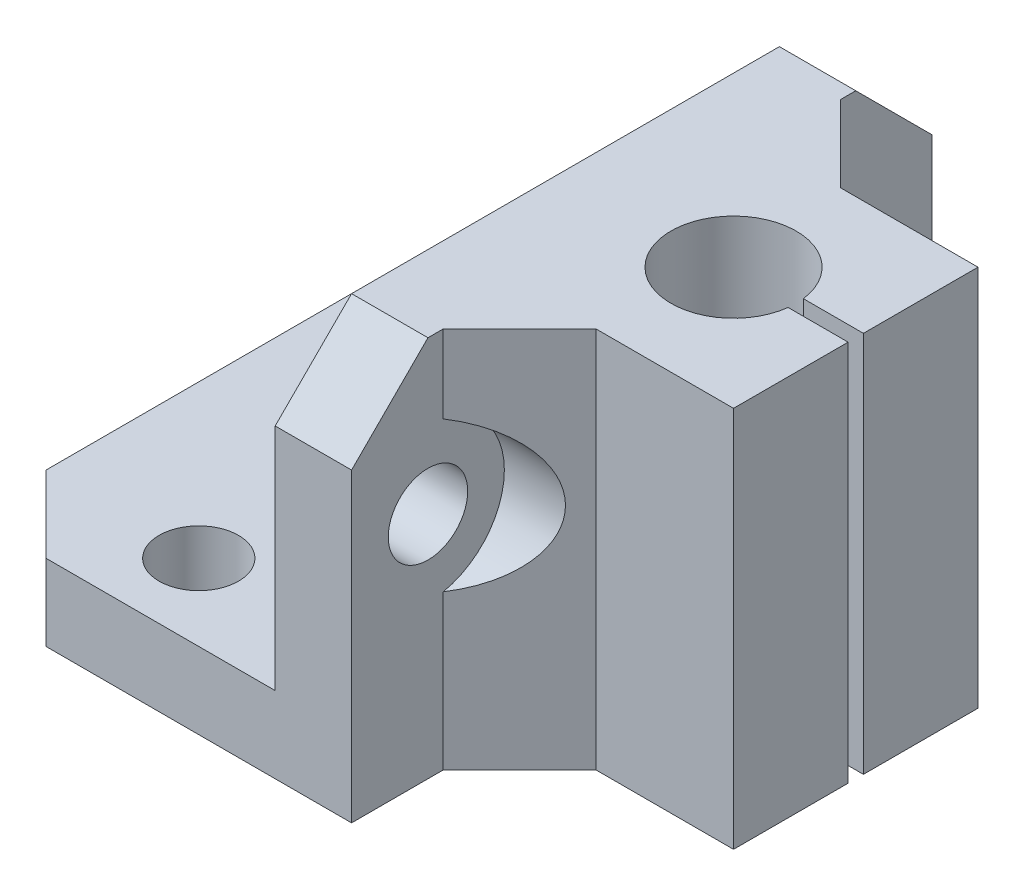
ISO-10303-21;
HEADER;
FILE_DESCRIPTION(('STEP AP214'),'2;1');
FILE_NAME('part.step','',(''),(''),'','','');
FILE_SCHEMA(('AUTOMOTIVE_DESIGN { 1 0 10303 214 1 1 1 1 }'));
ENDSEC;
DATA;
#1=APPLICATION_CONTEXT('core data for automotive mechanical design processes');
#2=APPLICATION_PROTOCOL_DEFINITION('international standard','automotive_design',2000,#1);
#3=PRODUCT_CONTEXT('',#1,'mechanical');
#4=PRODUCT('Part','Part','',(#3));
#5=PRODUCT_RELATED_PRODUCT_CATEGORY('part','',(#4));
#6=PRODUCT_DEFINITION_FORMATION('','',#4);
#7=PRODUCT_DEFINITION_CONTEXT('part definition',#1,'design');
#8=PRODUCT_DEFINITION('design','',#6,#7);
#9=PRODUCT_DEFINITION_SHAPE('','',#8);
#10=(LENGTH_UNIT() NAMED_UNIT(*) SI_UNIT(.MILLI.,.METRE.));
#11=(NAMED_UNIT(*) PLANE_ANGLE_UNIT() SI_UNIT($,.RADIAN.));
#12=(NAMED_UNIT(*) SI_UNIT($,.STERADIAN.) SOLID_ANGLE_UNIT());
#13=UNCERTAINTY_MEASURE_WITH_UNIT(LENGTH_MEASURE(1.E-05),#10,'distance_accuracy_value','');
#14=(GEOMETRIC_REPRESENTATION_CONTEXT(3) GLOBAL_UNCERTAINTY_ASSIGNED_CONTEXT((#13)) GLOBAL_UNIT_ASSIGNED_CONTEXT((#10,
#11,#12)) REPRESENTATION_CONTEXT('',''));
#15=CARTESIAN_POINT('',(0.,0.,0.));
#16=DIRECTION('',(0.,0.,1.));
#17=DIRECTION('',(1.,0.,0.));
#18=AXIS2_PLACEMENT_3D('',#15,#16,#17);
#19=CARTESIAN_POINT('',(0.,5.,0.));
#20=DIRECTION('',(0.,0.,-1.));
#21=DIRECTION('',(-1.,0.,0.));
#22=AXIS2_PLACEMENT_3D('',#19,#20,#21);
#23=PLANE('',#22);
#24=DIRECTION('',(1.,0.,0.));
#25=VECTOR('',#24,1.);
#26=CARTESIAN_POINT('',(0.,0.,0.));
#27=LINE('',#26,#25);
#28=CARTESIAN_POINT('',(5.00000000000002,0.,0.));
#29=VERTEX_POINT('',#28);
#30=CARTESIAN_POINT('',(25.,0.,0.));
#31=VERTEX_POINT('',#30);
#32=EDGE_CURVE('E282',#29,#31,#27,.T.);
#33=ORIENTED_EDGE('',*,*,#32,.F.);
#34=DIRECTION('',(0.,1.,0.));
#35=VECTOR('',#34,1.);
#36=CARTESIAN_POINT('',(5.00000000000002,5.,0.));
#37=LINE('',#36,#35);
#38=CARTESIAN_POINT('',(5.00000000000002,5.,0.));
#39=VERTEX_POINT('',#38);
#40=EDGE_CURVE('E60',#29,#39,#37,.T.);
#41=ORIENTED_EDGE('',*,*,#40,.T.);
#42=DIRECTION('',(1.,0.,0.));
#43=VECTOR('',#42,1.);
#44=CARTESIAN_POINT('',(0.,5.,0.));
#45=LINE('',#44,#43);
#46=CARTESIAN_POINT('',(20.,5.,0.));
#47=VERTEX_POINT('',#46);
#48=EDGE_CURVE('E269',#39,#47,#45,.T.);
#49=ORIENTED_EDGE('',*,*,#48,.T.);
#50=DIRECTION('',(0.,-1.,0.));
#51=VECTOR('',#50,1.);
#52=CARTESIAN_POINT('',(20.,25.,0.));
#53=LINE('',#52,#51);
#54=CARTESIAN_POINT('',(20.,20.,0.));
#55=VERTEX_POINT('',#54);
#56=EDGE_CURVE('E307',#55,#47,#53,.T.);
#57=ORIENTED_EDGE('',*,*,#56,.F.);
#58=DIRECTION('',(1.,0.,0.));
#59=VECTOR('',#58,1.);
#60=CARTESIAN_POINT('',(0.,20.,0.));
#61=LINE('',#60,#59);
#62=CARTESIAN_POINT('',(25.,20.,0.));
#63=VERTEX_POINT('',#62);
#64=EDGE_CURVE('E203',#55,#63,#61,.T.);
#65=ORIENTED_EDGE('',*,*,#64,.T.);
#66=DIRECTION('',(0.,-1.,0.));
#67=VECTOR('',#66,1.);
#68=CARTESIAN_POINT('',(25.,25.,0.));
#69=LINE('',#68,#67);
#70=EDGE_CURVE('E285',#63,#31,#69,.T.);
#71=ORIENTED_EDGE('',*,*,#70,.T.);
#72=EDGE_LOOP('',(#33,#41,#49,#57,#65,#71));
#73=FACE_BOUND('',#72,.T.);
#74=ADVANCED_FACE('F37',(#73),#23,.T.);
#75=CARTESIAN_POINT('',(0.,5.,0.));
#76=DIRECTION('',(1.,0.,0.));
#77=DIRECTION('',(0.,0.,-1.));
#78=AXIS2_PLACEMENT_3D('',#75,#76,#77);
#79=PLANE('',#78);
#80=DIRECTION('',(0.,0.,1.));
#81=VECTOR('',#80,1.);
#82=CARTESIAN_POINT('',(0.,5.,0.));
#83=LINE('',#82,#81);
#84=CARTESIAN_POINT('',(0.,5.,5.));
#85=VERTEX_POINT('',#84);
#86=CARTESIAN_POINT('',(0.,5.,33.));
#87=VERTEX_POINT('',#86);
#88=EDGE_CURVE('E267',#85,#87,#83,.T.);
#89=ORIENTED_EDGE('',*,*,#88,.F.);
#90=DIRECTION('',(0.,-1.,0.));
#91=VECTOR('',#90,1.);
#92=CARTESIAN_POINT('',(0.,0.,5.));
#93=LINE('',#92,#91);
#94=CARTESIAN_POINT('',(0.,0.,5.));
#95=VERTEX_POINT('',#94);
#96=EDGE_CURVE('E256',#85,#95,#93,.T.);
#97=ORIENTED_EDGE('',*,*,#96,.T.);
#98=DIRECTION('',(0.,0.,1.));
#99=VECTOR('',#98,1.);
#100=CARTESIAN_POINT('',(0.,0.,0.));
#101=LINE('',#100,#99);
#102=CARTESIAN_POINT('',(0.,0.,33.));
#103=VERTEX_POINT('',#102);
#104=EDGE_CURVE('E284',#95,#103,#101,.T.);
#105=ORIENTED_EDGE('',*,*,#104,.T.);
#106=DIRECTION('',(0.,1.,0.));
#107=VECTOR('',#106,1.);
#108=CARTESIAN_POINT('',(0.,5.,33.));
#109=LINE('',#108,#107);
#110=EDGE_CURVE('E254',#103,#87,#109,.T.);
#111=ORIENTED_EDGE('',*,*,#110,.T.);
#112=EDGE_LOOP('',(#89,#97,#105,#111));
#113=FACE_BOUND('',#112,.T.);
#114=ADVANCED_FACE('F273',(#113),#79,.F.);
#115=CARTESIAN_POINT('',(10.,5.,5.));
#116=DIRECTION('',(0.,-1.,0.));
#117=DIRECTION('',(0.,0.,-1.));
#118=AXIS2_PLACEMENT_3D('',#115,#116,#117);
#119=CYLINDRICAL_SURFACE('',#118,2.6);
#120=CARTESIAN_POINT('',(10.,5.,5.));
#121=DIRECTION('',(0.,1.,0.));
#122=DIRECTION('',(0.,0.,1.));
#123=AXIS2_PLACEMENT_3D('',#120,#121,#122);
#124=CIRCLE('',#123,2.6);
#125=CARTESIAN_POINT('',(10.,5.,7.6));
#126=VERTEX_POINT('',#125);
#127=EDGE_CURVE('E300',#126,#126,#124,.T.);
#128=ORIENTED_EDGE('',*,*,#127,.T.);
#129=EDGE_LOOP('',(#128));
#130=FACE_BOUND('',#129,.T.);
#131=CARTESIAN_POINT('',(10.,0.,5.));
#132=DIRECTION('',(0.,1.,0.));
#133=DIRECTION('',(0.,0.,1.));
#134=AXIS2_PLACEMENT_3D('',#131,#132,#133);
#135=CIRCLE('',#134,2.6);
#136=CARTESIAN_POINT('',(10.,0.,7.6));
#137=VERTEX_POINT('',#136);
#138=EDGE_CURVE('E287',#137,#137,#135,.T.);
#139=ORIENTED_EDGE('',*,*,#138,.F.);
#140=EDGE_LOOP('',(#139));
#141=FACE_BOUND('',#140,.T.);
#142=ADVANCED_FACE('F470',(#130,#141),#119,.F.);
#143=CARTESIAN_POINT('',(10.,5.,33.));
#144=DIRECTION('',(0.,-1.,0.));
#145=DIRECTION('',(0.,0.,-1.));
#146=AXIS2_PLACEMENT_3D('',#143,#144,#145);
#147=CYLINDRICAL_SURFACE('',#146,2.6);
#148=CARTESIAN_POINT('',(10.,5.,33.));
#149=DIRECTION('',(0.,1.,0.));
#150=DIRECTION('',(0.,0.,1.));
#151=AXIS2_PLACEMENT_3D('',#148,#149,#150);
#152=CIRCLE('',#151,2.6);
#153=CARTESIAN_POINT('',(10.,5.,35.6));
#154=VERTEX_POINT('',#153);
#155=EDGE_CURVE('E303',#154,#154,#152,.T.);
#156=ORIENTED_EDGE('',*,*,#155,.T.);
#157=EDGE_LOOP('',(#156));
#158=FACE_BOUND('',#157,.T.);
#159=CARTESIAN_POINT('',(10.,0.,33.));
#160=DIRECTION('',(0.,1.,0.));
#161=DIRECTION('',(0.,0.,1.));
#162=AXIS2_PLACEMENT_3D('',#159,#160,#161);
#163=CIRCLE('',#162,2.6);
#164=CARTESIAN_POINT('',(10.,0.,35.6));
#165=VERTEX_POINT('',#164);
#166=EDGE_CURVE('E290',#165,#165,#163,.T.);
#167=ORIENTED_EDGE('',*,*,#166,.F.);
#168=EDGE_LOOP('',(#167));
#169=FACE_BOUND('',#168,.T.);
#170=ADVANCED_FACE('F476',(#158,#169),#147,.F.);
#171=CARTESIAN_POINT('',(0.,5.,38.));
#172=DIRECTION('',(0.,0.,-1.));
#173=DIRECTION('',(-1.,0.,0.));
#174=AXIS2_PLACEMENT_3D('',#171,#172,#173);
#175=PLANE('',#174);
#176=DIRECTION('',(1.,0.,0.));
#177=VECTOR('',#176,1.);
#178=CARTESIAN_POINT('',(0.,5.,38.));
#179=LINE('',#178,#177);
#180=CARTESIAN_POINT('',(5.,5.,38.));
#181=VERTEX_POINT('',#180);
#182=CARTESIAN_POINT('',(20.,5.,38.));
#183=VERTEX_POINT('',#182);
#184=EDGE_CURVE('E216',#181,#183,#179,.T.);
#185=ORIENTED_EDGE('',*,*,#184,.F.);
#186=DIRECTION('',(0.,-1.,0.));
#187=VECTOR('',#186,1.);
#188=CARTESIAN_POINT('',(5.,5.,38.));
#189=LINE('',#188,#187);
#190=CARTESIAN_POINT('',(5.,0.,38.));
#191=VERTEX_POINT('',#190);
#192=EDGE_CURVE('E11',#181,#191,#189,.T.);
#193=ORIENTED_EDGE('',*,*,#192,.T.);
#194=DIRECTION('',(1.,0.,0.));
#195=VECTOR('',#194,1.);
#196=CARTESIAN_POINT('',(0.,0.,38.));
#197=LINE('',#196,#195);
#198=CARTESIAN_POINT('',(25.,0.,38.));
#199=VERTEX_POINT('',#198);
#200=EDGE_CURVE('E218',#191,#199,#197,.T.);
#201=ORIENTED_EDGE('',*,*,#200,.T.);
#202=DIRECTION('',(0.,-1.,0.));
#203=VECTOR('',#202,1.);
#204=CARTESIAN_POINT('',(25.,25.,38.));
#205=LINE('',#204,#203);
#206=CARTESIAN_POINT('',(25.,20.,38.));
#207=VERTEX_POINT('',#206);
#208=EDGE_CURVE('E313',#207,#199,#205,.T.);
#209=ORIENTED_EDGE('',*,*,#208,.F.);
#210=DIRECTION('',(-1.,0.,0.));
#211=VECTOR('',#210,1.);
#212=CARTESIAN_POINT('',(20.,20.,38.));
#213=LINE('',#212,#211);
#214=CARTESIAN_POINT('',(20.,20.,38.));
#215=VERTEX_POINT('',#214);
#216=EDGE_CURVE('E252',#207,#215,#213,.T.);
#217=ORIENTED_EDGE('',*,*,#216,.T.);
#218=DIRECTION('',(0.,-1.,0.));
#219=VECTOR('',#218,1.);
#220=CARTESIAN_POINT('',(20.,25.,38.));
#221=LINE('',#220,#219);
#222=EDGE_CURVE('E310',#215,#183,#221,.T.);
#223=ORIENTED_EDGE('',*,*,#222,.T.);
#224=EDGE_LOOP('',(#185,#193,#201,#209,#217,#223));
#225=FACE_BOUND('',#224,.T.);
#226=ADVANCED_FACE('F414',(#225),#175,.F.);
#227=CARTESIAN_POINT('',(0.,5.,0.));
#228=DIRECTION('',(0.,1.,0.));
#229=DIRECTION('',(0.,0.,1.));
#230=AXIS2_PLACEMENT_3D('',#227,#228,#229);
#231=PLANE('',#230);
#232=ORIENTED_EDGE('',*,*,#155,.F.);
#233=EDGE_LOOP('',(#232));
#234=FACE_BOUND('',#233,.T.);
#235=ORIENTED_EDGE('',*,*,#127,.F.);
#236=EDGE_LOOP('',(#235));
#237=FACE_BOUND('',#236,.T.);
#238=ORIENTED_EDGE('',*,*,#48,.F.);
#239=DIRECTION('',(-0.707106781186549,0.,0.707106781186546));
#240=VECTOR('',#239,1.);
#241=CARTESIAN_POINT('',(2.5,5.,2.50000000000001));
#242=LINE('',#241,#240);
#243=EDGE_CURVE('E45',#39,#85,#242,.T.);
#244=ORIENTED_EDGE('',*,*,#243,.T.);
#245=ORIENTED_EDGE('',*,*,#88,.T.);
#246=DIRECTION('',(-0.707106781186546,0.,-0.707106781186549));
#247=VECTOR('',#246,1.);
#248=CARTESIAN_POINT('',(-16.5,5.,16.4999999999999));
#249=LINE('',#248,#247);
#250=EDGE_CURVE('E52',#87,#181,#249,.F.);
#251=ORIENTED_EDGE('',*,*,#250,.T.);
#252=ORIENTED_EDGE('',*,*,#184,.T.);
#253=DIRECTION('',(0.,0.,1.));
#254=VECTOR('',#253,1.);
#255=CARTESIAN_POINT('',(20.,5.,0.));
#256=LINE('',#255,#254);
#257=EDGE_CURVE('E297',#47,#183,#256,.T.);
#258=ORIENTED_EDGE('',*,*,#257,.F.);
#259=EDGE_LOOP('',(#238,#244,#245,#251,#252,#258));
#260=FACE_BOUND('',#259,.T.);
#261=ADVANCED_FACE('F266',(#234,#237,#260),#231,.T.);
#262=CARTESIAN_POINT('',(0.,0.,0.));
#263=DIRECTION('',(0.,1.,0.));
#264=DIRECTION('',(0.,0.,1.));
#265=AXIS2_PLACEMENT_3D('',#262,#263,#264);
#266=PLANE('',#265);
#267=ORIENTED_EDGE('',*,*,#166,.T.);
#268=EDGE_LOOP('',(#267));
#269=FACE_BOUND('',#268,.T.);
#270=ORIENTED_EDGE('',*,*,#138,.T.);
#271=EDGE_LOOP('',(#270));
#272=FACE_BOUND('',#271,.T.);
#273=ORIENTED_EDGE('',*,*,#104,.F.);
#274=DIRECTION('',(0.707106781186549,0.,-0.707106781186546));
#275=VECTOR('',#274,1.);
#276=CARTESIAN_POINT('',(0.,0.,5.));
#277=LINE('',#276,#275);
#278=EDGE_CURVE('E261',#95,#29,#277,.T.);
#279=ORIENTED_EDGE('',*,*,#278,.T.);
#280=ORIENTED_EDGE('',*,*,#32,.T.);
#281=DIRECTION('',(0.,0.,1.));
#282=VECTOR('',#281,1.);
#283=CARTESIAN_POINT('',(25.,0.,0.));
#284=LINE('',#283,#282);
#285=CARTESIAN_POINT('',(25.,0.,5.99999999999997));
#286=VERTEX_POINT('',#285);
#287=EDGE_CURVE('E349',#31,#286,#284,.T.);
#288=ORIENTED_EDGE('',*,*,#287,.T.);
#289=DIRECTION('',(-0.707106781186544,0.,-0.707106781186551));
#290=VECTOR('',#289,1.);
#291=CARTESIAN_POINT('',(9.50000000000015,0.,-9.50000000000005));
#292=LINE('',#291,#290);
#293=CARTESIAN_POINT('',(30.,0.,11.));
#294=VERTEX_POINT('',#293);
#295=EDGE_CURVE('E227',#286,#294,#292,.F.);
#296=ORIENTED_EDGE('',*,*,#295,.T.);
#297=DIRECTION('',(1.,0.,0.));
#298=VECTOR('',#297,1.);
#299=CARTESIAN_POINT('',(0.,0.,11.));
#300=LINE('',#299,#298);
#301=CARTESIAN_POINT('',(39.,0.,11.));
#302=VERTEX_POINT('',#301);
#303=EDGE_CURVE('E331',#294,#302,#300,.T.);
#304=ORIENTED_EDGE('',*,*,#303,.T.);
#305=DIRECTION('',(0.,0.,1.));
#306=VECTOR('',#305,1.);
#307=CARTESIAN_POINT('',(39.,0.,0.));
#308=LINE('',#307,#306);
#309=CARTESIAN_POINT('',(39.,0.,18.5));
#310=VERTEX_POINT('',#309);
#311=EDGE_CURVE('E333',#302,#310,#308,.T.);
#312=ORIENTED_EDGE('',*,*,#311,.T.);
#313=DIRECTION('',(1.,0.,0.));
#314=VECTOR('',#313,1.);
#315=CARTESIAN_POINT('',(0.,0.,18.5));
#316=LINE('',#315,#314);
#317=CARTESIAN_POINT('',(35.0693979898752,0.,18.5));
#318=VERTEX_POINT('',#317);
#319=EDGE_CURVE('E334',#318,#310,#316,.T.);
#320=ORIENTED_EDGE('',*,*,#319,.F.);
#321=CARTESIAN_POINT('',(31.,0.,19.));
#322=DIRECTION('',(0.,1.,0.));
#323=DIRECTION('',(0.,0.,1.));
#324=AXIS2_PLACEMENT_3D('',#321,#322,#323);
#325=CIRCLE('',#324,4.10000000000002);
#326=CARTESIAN_POINT('',(35.0693979898752,0.,19.5));
#327=VERTEX_POINT('',#326);
#328=EDGE_CURVE('E337',#318,#327,#325,.T.);
#329=ORIENTED_EDGE('',*,*,#328,.T.);
#330=DIRECTION('',(1.,0.,0.));
#331=VECTOR('',#330,1.);
#332=CARTESIAN_POINT('',(0.,0.,19.5));
#333=LINE('',#332,#331);
#334=CARTESIAN_POINT('',(39.,0.,19.5));
#335=VERTEX_POINT('',#334);
#336=EDGE_CURVE('E340',#327,#335,#333,.T.);
#337=ORIENTED_EDGE('',*,*,#336,.T.);
#338=CARTESIAN_POINT('',(39.,0.,27.));
#339=VERTEX_POINT('',#338);
#340=EDGE_CURVE('E343',#335,#339,#308,.T.);
#341=ORIENTED_EDGE('',*,*,#340,.T.);
#342=DIRECTION('',(1.,0.,0.));
#343=VECTOR('',#342,1.);
#344=CARTESIAN_POINT('',(0.,0.,27.));
#345=LINE('',#344,#343);
#346=CARTESIAN_POINT('',(30.,0.,27.));
#347=VERTEX_POINT('',#346);
#348=EDGE_CURVE('E346',#347,#339,#345,.T.);
#349=ORIENTED_EDGE('',*,*,#348,.F.);
#350=DIRECTION('',(-0.707106781186551,0.,0.707106781186544));
#351=VECTOR('',#350,1.);
#352=CARTESIAN_POINT('',(28.4999999999999,0.,28.5000000000002));
#353=LINE('',#352,#351);
#354=CARTESIAN_POINT('',(25.,0.,32.));
#355=VERTEX_POINT('',#354);
#356=EDGE_CURVE('E231',#347,#355,#353,.T.);
#357=ORIENTED_EDGE('',*,*,#356,.T.);
#358=EDGE_CURVE('E348',#355,#199,#284,.T.);
#359=ORIENTED_EDGE('',*,*,#358,.T.);
#360=ORIENTED_EDGE('',*,*,#200,.F.);
#361=DIRECTION('',(0.707106781186546,0.,0.707106781186549));
#362=VECTOR('',#361,1.);
#363=CARTESIAN_POINT('',(5.,0.,38.));
#364=LINE('',#363,#362);
#365=EDGE_CURVE('E259',#191,#103,#364,.F.);
#366=ORIENTED_EDGE('',*,*,#365,.T.);
#367=EDGE_LOOP('',(#273,#279,#280,#288,#296,#304,#312,#320,#329,#337,#341,#349,#357,#359,#360,#366));
#368=FACE_BOUND('',#367,.T.);
#369=ADVANCED_FACE('F280',(#269,#272,#368),#266,.F.);
#370=CARTESIAN_POINT('',(20.,25.,0.));
#371=DIRECTION('',(1.,0.,0.));
#372=DIRECTION('',(0.,0.,-1.));
#373=AXIS2_PLACEMENT_3D('',#370,#371,#372);
#374=PLANE('',#373);
#375=CARTESIAN_POINT('',(20.,15.,33.));
#376=DIRECTION('',(-1.,0.,0.));
#377=DIRECTION('',(0.,0.,1.));
#378=AXIS2_PLACEMENT_3D('',#375,#376,#377);
#379=CIRCLE('',#378,2.6);
#380=CARTESIAN_POINT('',(20.,15.,35.6));
#381=VERTEX_POINT('',#380);
#382=EDGE_CURVE('E380',#381,#381,#379,.T.);
#383=ORIENTED_EDGE('',*,*,#382,.F.);
#384=EDGE_LOOP('',(#383));
#385=FACE_BOUND('',#384,.T.);
#386=CARTESIAN_POINT('',(20.,15.,5.));
#387=DIRECTION('',(-1.,0.,0.));
#388=DIRECTION('',(0.,0.,1.));
#389=AXIS2_PLACEMENT_3D('',#386,#387,#388);
#390=CIRCLE('',#389,2.6);
#391=CARTESIAN_POINT('',(20.,15.,7.6));
#392=VERTEX_POINT('',#391);
#393=EDGE_CURVE('E374',#392,#392,#390,.T.);
#394=ORIENTED_EDGE('',*,*,#393,.F.);
#395=EDGE_LOOP('',(#394));
#396=FACE_BOUND('',#395,.T.);
#397=DIRECTION('',(0.,0.,1.));
#398=VECTOR('',#397,1.);
#399=CARTESIAN_POINT('',(20.,25.,0.));
#400=LINE('',#399,#398);
#401=CARTESIAN_POINT('',(20.,25.,5.00000000000002));
#402=VERTEX_POINT('',#401);
#403=CARTESIAN_POINT('',(20.,25.,33.));
#404=VERTEX_POINT('',#403);
#405=EDGE_CURVE('E368',#402,#404,#400,.T.);
#406=ORIENTED_EDGE('',*,*,#405,.F.);
#407=DIRECTION('',(0.,0.707106781186546,0.707106781186549));
#408=VECTOR('',#407,1.);
#409=CARTESIAN_POINT('',(20.,20.,0.));
#410=LINE('',#409,#408);
#411=EDGE_CURVE('E248',#402,#55,#410,.F.);
#412=ORIENTED_EDGE('',*,*,#411,.T.);
#413=ORIENTED_EDGE('',*,*,#56,.T.);
#414=ORIENTED_EDGE('',*,*,#257,.T.);
#415=ORIENTED_EDGE('',*,*,#222,.F.);
#416=DIRECTION('',(0.,0.707106781186549,-0.707106781186546));
#417=VECTOR('',#416,1.);
#418=CARTESIAN_POINT('',(20.,25.,33.));
#419=LINE('',#418,#417);
#420=EDGE_CURVE('E246',#215,#404,#419,.T.);
#421=ORIENTED_EDGE('',*,*,#420,.T.);
#422=EDGE_LOOP('',(#406,#412,#413,#414,#415,#421));
#423=FACE_BOUND('',#422,.T.);
#424=ADVANCED_FACE('F420',(#385,#396,#423),#374,.F.);
#425=CARTESIAN_POINT('',(25.,25.,0.));
#426=DIRECTION('',(1.,0.,0.));
#427=DIRECTION('',(0.,0.,-1.));
#428=AXIS2_PLACEMENT_3D('',#425,#426,#427);
#429=PLANE('',#428);
#430=ORIENTED_EDGE('',*,*,#70,.F.);
#431=DIRECTION('',(0.,-0.707106781186546,-0.707106781186549));
#432=VECTOR('',#431,1.);
#433=CARTESIAN_POINT('',(25.,22.5,2.5));
#434=LINE('',#433,#432);
#435=CARTESIAN_POINT('',(25.,25.,5.00000000000002));
#436=VERTEX_POINT('',#435);
#437=EDGE_CURVE('E239',#63,#436,#434,.F.);
#438=ORIENTED_EDGE('',*,*,#437,.T.);
#439=DIRECTION('',(0.,0.,1.));
#440=VECTOR('',#439,1.);
#441=CARTESIAN_POINT('',(25.,25.,0.));
#442=LINE('',#441,#440);
#443=CARTESIAN_POINT('',(25.,25.,5.99999999999997));
#444=VERTEX_POINT('',#443);
#445=EDGE_CURVE('E210',#436,#444,#442,.T.);
#446=ORIENTED_EDGE('',*,*,#445,.T.);
#447=DIRECTION('',(0.,-1.,0.));
#448=VECTOR('',#447,1.);
#449=CARTESIAN_POINT('',(25.,0.,5.99999999999997));
#450=LINE('',#449,#448);
#451=CARTESIAN_POINT('',(25.,19.8989794855664,5.99999999999997));
#452=VERTEX_POINT('',#451);
#453=EDGE_CURVE('E200',#444,#452,#450,.T.);
#454=ORIENTED_EDGE('',*,*,#453,.T.);
#455=CARTESIAN_POINT('',(25.,15.,5.));
#456=DIRECTION('',(-1.,0.,0.));
#457=DIRECTION('',(0.,0.,1.));
#458=AXIS2_PLACEMENT_3D('',#455,#456,#457);
#459=CIRCLE('',#458,5.);
#460=CARTESIAN_POINT('',(25.,10.1010205144336,5.99999999999997));
#461=VERTEX_POINT('',#460);
#462=EDGE_CURVE('E187',#461,#452,#459,.T.);
#463=ORIENTED_EDGE('',*,*,#462,.F.);
#464=EDGE_CURVE('E202',#461,#286,#450,.T.);
#465=ORIENTED_EDGE('',*,*,#464,.T.);
#466=ORIENTED_EDGE('',*,*,#287,.F.);
#467=EDGE_LOOP('',(#430,#438,#446,#454,#463,#465,#466));
#468=FACE_BOUND('',#467,.T.);
#469=CARTESIAN_POINT('',(25.,15.,5.));
#470=DIRECTION('',(1.,0.,0.));
#471=DIRECTION('',(0.,0.,-1.));
#472=AXIS2_PLACEMENT_3D('',#469,#470,#471);
#473=CIRCLE('',#472,2.6);
#474=CARTESIAN_POINT('',(25.,15.,2.4));
#475=VERTEX_POINT('',#474);
#476=EDGE_CURVE('E351',#475,#475,#473,.T.);
#477=ORIENTED_EDGE('',*,*,#476,.F.);
#478=EDGE_LOOP('',(#477));
#479=FACE_BOUND('',#478,.T.);
#480=ADVANCED_FACE('F207',(#468,#479),#429,.T.);
#481=CARTESIAN_POINT('',(25.,25.,32.));
#482=VERTEX_POINT('',#481);
#483=CARTESIAN_POINT('',(25.,25.,33.));
#484=VERTEX_POINT('',#483);
#485=EDGE_CURVE('E367',#482,#484,#442,.T.);
#486=ORIENTED_EDGE('',*,*,#485,.T.);
#487=DIRECTION('',(0.,-0.707106781186549,0.707106781186546));
#488=VECTOR('',#487,1.);
#489=CARTESIAN_POINT('',(25.,41.5,16.5000000000001));
#490=LINE('',#489,#488);
#491=EDGE_CURVE('E250',#484,#207,#490,.T.);
#492=ORIENTED_EDGE('',*,*,#491,.T.);
#493=ORIENTED_EDGE('',*,*,#208,.T.);
#494=ORIENTED_EDGE('',*,*,#358,.F.);
#495=DIRECTION('',(0.,1.,0.));
#496=VECTOR('',#495,1.);
#497=CARTESIAN_POINT('',(25.,25.,32.));
#498=LINE('',#497,#496);
#499=CARTESIAN_POINT('',(25.,10.1010205144337,32.));
#500=VERTEX_POINT('',#499);
#501=EDGE_CURVE('E224',#355,#500,#498,.T.);
#502=ORIENTED_EDGE('',*,*,#501,.T.);
#503=CARTESIAN_POINT('',(25.,15.,33.));
#504=DIRECTION('',(-1.,0.,0.));
#505=DIRECTION('',(0.,0.,1.));
#506=AXIS2_PLACEMENT_3D('',#503,#504,#505);
#507=CIRCLE('',#506,5.);
#508=CARTESIAN_POINT('',(25.,19.8989794855663,32.));
#509=VERTEX_POINT('',#508);
#510=EDGE_CURVE('E194',#509,#500,#507,.T.);
#511=ORIENTED_EDGE('',*,*,#510,.F.);
#512=EDGE_CURVE('E223',#509,#482,#498,.T.);
#513=ORIENTED_EDGE('',*,*,#512,.T.);
#514=EDGE_LOOP('',(#486,#492,#493,#494,#502,#511,#513));
#515=FACE_BOUND('',#514,.T.);
#516=CARTESIAN_POINT('',(25.,15.,33.));
#517=DIRECTION('',(1.,0.,0.));
#518=DIRECTION('',(0.,0.,-1.));
#519=AXIS2_PLACEMENT_3D('',#516,#517,#518);
#520=CIRCLE('',#519,2.6);
#521=CARTESIAN_POINT('',(25.,15.,30.4));
#522=VERTEX_POINT('',#521);
#523=EDGE_CURVE('E377',#522,#522,#520,.T.);
#524=ORIENTED_EDGE('',*,*,#523,.F.);
#525=EDGE_LOOP('',(#524));
#526=FACE_BOUND('',#525,.T.);
#527=ADVANCED_FACE('F394',(#515,#526),#429,.T.);
#528=CARTESIAN_POINT('',(0.,25.,27.));
#529=DIRECTION('',(0.,0.,-1.));
#530=DIRECTION('',(-1.,0.,0.));
#531=AXIS2_PLACEMENT_3D('',#528,#529,#530);
#532=PLANE('',#531);
#533=DIRECTION('',(1.,0.,0.));
#534=VECTOR('',#533,1.);
#535=CARTESIAN_POINT('',(0.,25.,27.));
#536=LINE('',#535,#534);
#537=CARTESIAN_POINT('',(30.,25.,27.));
#538=VERTEX_POINT('',#537);
#539=CARTESIAN_POINT('',(39.,25.,27.));
#540=VERTEX_POINT('',#539);
#541=EDGE_CURVE('E365',#538,#540,#536,.T.);
#542=ORIENTED_EDGE('',*,*,#541,.F.);
#543=DIRECTION('',(0.,-1.,0.));
#544=VECTOR('',#543,1.);
#545=CARTESIAN_POINT('',(30.,25.,27.));
#546=LINE('',#545,#544);
#547=EDGE_CURVE('E214',#538,#347,#546,.T.);
#548=ORIENTED_EDGE('',*,*,#547,.T.);
#549=ORIENTED_EDGE('',*,*,#348,.T.);
#550=DIRECTION('',(0.,-1.,0.));
#551=VECTOR('',#550,1.);
#552=CARTESIAN_POINT('',(39.,25.,27.));
#553=LINE('',#552,#551);
#554=EDGE_CURVE('E316',#540,#339,#553,.T.);
#555=ORIENTED_EDGE('',*,*,#554,.F.);
#556=EDGE_LOOP('',(#542,#548,#549,#555));
#557=FACE_BOUND('',#556,.T.);
#558=ADVANCED_FACE('F403',(#557),#532,.F.);
#559=CARTESIAN_POINT('',(39.,25.,0.));
#560=DIRECTION('',(1.,0.,0.));
#561=DIRECTION('',(0.,0.,-1.));
#562=AXIS2_PLACEMENT_3D('',#559,#560,#561);
#563=PLANE('',#562);
#564=ORIENTED_EDGE('',*,*,#340,.F.);
#565=DIRECTION('',(0.,-1.,0.));
#566=VECTOR('',#565,1.);
#567=CARTESIAN_POINT('',(39.,25.,19.5));
#568=LINE('',#567,#566);
#569=CARTESIAN_POINT('',(39.,25.,19.5));
#570=VERTEX_POINT('',#569);
#571=EDGE_CURVE('E319',#570,#335,#568,.T.);
#572=ORIENTED_EDGE('',*,*,#571,.F.);
#573=DIRECTION('',(0.,0.,1.));
#574=VECTOR('',#573,1.);
#575=CARTESIAN_POINT('',(39.,25.,0.));
#576=LINE('',#575,#574);
#577=EDGE_CURVE('E362',#570,#540,#576,.T.);
#578=ORIENTED_EDGE('',*,*,#577,.T.);
#579=ORIENTED_EDGE('',*,*,#554,.T.);
#580=EDGE_LOOP('',(#564,#572,#578,#579));
#581=FACE_BOUND('',#580,.T.);
#582=ADVANCED_FACE('F452',(#581),#563,.T.);
#583=CARTESIAN_POINT('',(0.,25.,19.5));
#584=DIRECTION('',(0.,0.,-1.));
#585=DIRECTION('',(-1.,0.,0.));
#586=AXIS2_PLACEMENT_3D('',#583,#584,#585);
#587=PLANE('',#586);
#588=ORIENTED_EDGE('',*,*,#336,.F.);
#589=DIRECTION('',(0.,-1.,0.));
#590=VECTOR('',#589,1.);
#591=CARTESIAN_POINT('',(35.0693979898752,25.,19.5));
#592=LINE('',#591,#590);
#593=CARTESIAN_POINT('',(35.0693979898752,25.,19.5));
#594=VERTEX_POINT('',#593);
#595=EDGE_CURVE('E321',#594,#327,#592,.T.);
#596=ORIENTED_EDGE('',*,*,#595,.F.);
#597=DIRECTION('',(1.,0.,0.));
#598=VECTOR('',#597,1.);
#599=CARTESIAN_POINT('',(0.,25.,19.5));
#600=LINE('',#599,#598);
#601=EDGE_CURVE('E359',#594,#570,#600,.T.);
#602=ORIENTED_EDGE('',*,*,#601,.T.);
#603=ORIENTED_EDGE('',*,*,#571,.T.);
#604=EDGE_LOOP('',(#588,#596,#602,#603));
#605=FACE_BOUND('',#604,.T.);
#606=ADVANCED_FACE('F449',(#605),#587,.T.);
#607=CARTESIAN_POINT('',(31.,25.,19.));
#608=DIRECTION('',(0.,-1.,0.));
#609=DIRECTION('',(0.,0.,-1.));
#610=AXIS2_PLACEMENT_3D('',#607,#608,#609);
#611=CYLINDRICAL_SURFACE('',#610,4.10000000000002);
#612=ORIENTED_EDGE('',*,*,#328,.F.);
#613=DIRECTION('',(0.,-1.,0.));
#614=VECTOR('',#613,1.);
#615=CARTESIAN_POINT('',(35.0693979898752,25.,18.5));
#616=LINE('',#615,#614);
#617=CARTESIAN_POINT('',(35.0693979898752,25.,18.5));
#618=VERTEX_POINT('',#617);
#619=EDGE_CURVE('E323',#618,#318,#616,.T.);
#620=ORIENTED_EDGE('',*,*,#619,.F.);
#621=CARTESIAN_POINT('',(31.,25.,19.));
#622=DIRECTION('',(0.,1.,0.));
#623=DIRECTION('',(0.,0.,1.));
#624=AXIS2_PLACEMENT_3D('',#621,#622,#623);
#625=CIRCLE('',#624,4.10000000000002);
#626=EDGE_CURVE('E356',#618,#594,#625,.T.);
#627=ORIENTED_EDGE('',*,*,#626,.T.);
#628=ORIENTED_EDGE('',*,*,#595,.T.);
#629=EDGE_LOOP('',(#612,#620,#627,#628));
#630=FACE_BOUND('',#629,.T.);
#631=ADVANCED_FACE('F444',(#630),#611,.F.);
#632=CARTESIAN_POINT('',(0.,25.,18.5));
#633=DIRECTION('',(0.,0.,-1.));
#634=DIRECTION('',(-1.,0.,0.));
#635=AXIS2_PLACEMENT_3D('',#632,#633,#634);
#636=PLANE('',#635);
#637=ORIENTED_EDGE('',*,*,#319,.T.);
#638=DIRECTION('',(0.,-1.,0.));
#639=VECTOR('',#638,1.);
#640=CARTESIAN_POINT('',(39.,25.,18.5));
#641=LINE('',#640,#639);
#642=CARTESIAN_POINT('',(39.,25.,18.5));
#643=VERTEX_POINT('',#642);
#644=EDGE_CURVE('E325',#643,#310,#641,.T.);
#645=ORIENTED_EDGE('',*,*,#644,.F.);
#646=DIRECTION('',(1.,0.,0.));
#647=VECTOR('',#646,1.);
#648=CARTESIAN_POINT('',(0.,25.,18.5));
#649=LINE('',#648,#647);
#650=EDGE_CURVE('E354',#618,#643,#649,.T.);
#651=ORIENTED_EDGE('',*,*,#650,.F.);
#652=ORIENTED_EDGE('',*,*,#619,.T.);
#653=EDGE_LOOP('',(#637,#645,#651,#652));
#654=FACE_BOUND('',#653,.T.);
#655=ADVANCED_FACE('F464',(#654),#636,.F.);
#656=ORIENTED_EDGE('',*,*,#311,.F.);
#657=DIRECTION('',(0.,-1.,0.));
#658=VECTOR('',#657,1.);
#659=CARTESIAN_POINT('',(39.,25.,11.));
#660=LINE('',#659,#658);
#661=CARTESIAN_POINT('',(39.,25.,11.));
#662=VERTEX_POINT('',#661);
#663=EDGE_CURVE('E327',#662,#302,#660,.T.);
#664=ORIENTED_EDGE('',*,*,#663,.F.);
#665=EDGE_CURVE('E353',#662,#643,#576,.T.);
#666=ORIENTED_EDGE('',*,*,#665,.T.);
#667=ORIENTED_EDGE('',*,*,#644,.T.);
#668=EDGE_LOOP('',(#656,#664,#666,#667));
#669=FACE_BOUND('',#668,.T.);
#670=ADVANCED_FACE('F438',(#669),#563,.T.);
#671=CARTESIAN_POINT('',(0.,25.,11.));
#672=DIRECTION('',(0.,0.,-1.));
#673=DIRECTION('',(-1.,0.,0.));
#674=AXIS2_PLACEMENT_3D('',#671,#672,#673);
#675=PLANE('',#674);
#676=ORIENTED_EDGE('',*,*,#303,.F.);
#677=DIRECTION('',(0.,1.,0.));
#678=VECTOR('',#677,1.);
#679=CARTESIAN_POINT('',(30.,25.,11.));
#680=LINE('',#679,#678);
#681=CARTESIAN_POINT('',(30.,25.,11.));
#682=VERTEX_POINT('',#681);
#683=EDGE_CURVE('E212',#294,#682,#680,.T.);
#684=ORIENTED_EDGE('',*,*,#683,.T.);
#685=DIRECTION('',(1.,0.,0.));
#686=VECTOR('',#685,1.);
#687=CARTESIAN_POINT('',(0.,25.,11.));
#688=LINE('',#687,#686);
#689=EDGE_CURVE('E330',#682,#662,#688,.T.);
#690=ORIENTED_EDGE('',*,*,#689,.T.);
#691=ORIENTED_EDGE('',*,*,#663,.T.);
#692=EDGE_LOOP('',(#676,#684,#690,#691));
#693=FACE_BOUND('',#692,.T.);
#694=ADVANCED_FACE('F431',(#693),#675,.T.);
#695=CARTESIAN_POINT('',(0.,25.,0.));
#696=DIRECTION('',(0.,1.,0.));
#697=DIRECTION('',(0.,0.,1.));
#698=AXIS2_PLACEMENT_3D('',#695,#696,#697);
#699=PLANE('',#698);
#700=ORIENTED_EDGE('',*,*,#445,.F.);
#701=DIRECTION('',(-1.,0.,0.));
#702=VECTOR('',#701,1.);
#703=CARTESIAN_POINT('',(0.,25.,5.00000000000002));
#704=LINE('',#703,#702);
#705=EDGE_CURVE('E244',#436,#402,#704,.T.);
#706=ORIENTED_EDGE('',*,*,#705,.T.);
#707=ORIENTED_EDGE('',*,*,#405,.T.);
#708=DIRECTION('',(1.,0.,0.));
#709=VECTOR('',#708,1.);
#710=CARTESIAN_POINT('',(25.,25.,33.));
#711=LINE('',#710,#709);
#712=EDGE_CURVE('E241',#404,#484,#711,.T.);
#713=ORIENTED_EDGE('',*,*,#712,.T.);
#714=ORIENTED_EDGE('',*,*,#485,.F.);
#715=DIRECTION('',(0.707106781186551,0.,-0.707106781186544));
#716=VECTOR('',#715,1.);
#717=CARTESIAN_POINT('',(30.,25.,27.));
#718=LINE('',#717,#716);
#719=EDGE_CURVE('E233',#482,#538,#718,.T.);
#720=ORIENTED_EDGE('',*,*,#719,.T.);
#721=ORIENTED_EDGE('',*,*,#541,.T.);
#722=ORIENTED_EDGE('',*,*,#577,.F.);
#723=ORIENTED_EDGE('',*,*,#601,.F.);
#724=ORIENTED_EDGE('',*,*,#626,.F.);
#725=ORIENTED_EDGE('',*,*,#650,.T.);
#726=ORIENTED_EDGE('',*,*,#665,.F.);
#727=ORIENTED_EDGE('',*,*,#689,.F.);
#728=DIRECTION('',(0.707106781186544,0.,0.707106781186551));
#729=VECTOR('',#728,1.);
#730=CARTESIAN_POINT('',(25.,25.,5.99999999999997));
#731=LINE('',#730,#729);
#732=EDGE_CURVE('E229',#682,#444,#731,.F.);
#733=ORIENTED_EDGE('',*,*,#732,.T.);
#734=EDGE_LOOP('',(#700,#706,#707,#713,#714,#720,#721,#722,#723,#724,#725,#726,#727,#733));
#735=FACE_BOUND('',#734,.T.);
#736=ADVANCED_FACE('F407',(#735),#699,.T.);
#737=CARTESIAN_POINT('',(25.,25.,5.99999999999997));
#738=DIRECTION('',(0.707106781186552,0.,-0.707106781186544));
#739=DIRECTION('',(0.,1.,0.));
#740=AXIS2_PLACEMENT_3D('',#737,#738,#739);
#741=PLANE('',#740);
#742=ORIENTED_EDGE('',*,*,#464,.F.);
#743=CARTESIAN_POINT('',(24.,15.,5.));
#744=DIRECTION('',(0.707106781186552,0.,-0.707106781186544));
#745=DIRECTION('',(-0.707106781186544,0.,-0.707106781186551));
#746=AXIS2_PLACEMENT_3D('',#743,#744,#745);
#747=ELLIPSE('',#746,7.07106781186544,5.);
#748=EDGE_CURVE('E190',#461,#452,#747,.F.);
#749=ORIENTED_EDGE('',*,*,#748,.T.);
#750=ORIENTED_EDGE('',*,*,#453,.F.);
#751=ORIENTED_EDGE('',*,*,#732,.F.);
#752=ORIENTED_EDGE('',*,*,#683,.F.);
#753=ORIENTED_EDGE('',*,*,#295,.F.);
#754=EDGE_LOOP('',(#742,#749,#750,#751,#752,#753));
#755=FACE_BOUND('',#754,.T.);
#756=ADVANCED_FACE('F198',(#755),#741,.T.);
#757=CARTESIAN_POINT('',(30.,25.,27.));
#758=DIRECTION('',(-0.707106781186544,0.,-0.707106781186552));
#759=DIRECTION('',(0.,-1.,0.));
#760=AXIS2_PLACEMENT_3D('',#757,#758,#759);
#761=PLANE('',#760);
#762=ORIENTED_EDGE('',*,*,#512,.F.);
#763=CARTESIAN_POINT('',(24.,15.,33.));
#764=DIRECTION('',(-0.707106781186544,0.,-0.707106781186552));
#765=DIRECTION('',(-0.707106781186551,0.,0.707106781186544));
#766=AXIS2_PLACEMENT_3D('',#763,#764,#765);
#767=ELLIPSE('',#766,7.07106781186551,5.);
#768=EDGE_CURVE('E204',#509,#500,#767,.T.);
#769=ORIENTED_EDGE('',*,*,#768,.T.);
#770=ORIENTED_EDGE('',*,*,#501,.F.);
#771=ORIENTED_EDGE('',*,*,#356,.F.);
#772=ORIENTED_EDGE('',*,*,#547,.F.);
#773=ORIENTED_EDGE('',*,*,#719,.F.);
#774=EDGE_LOOP('',(#762,#769,#770,#771,#772,#773));
#775=FACE_BOUND('',#774,.T.);
#776=ADVANCED_FACE('F390',(#775),#761,.F.);
#777=CARTESIAN_POINT('',(39.,15.,5.));
#778=DIRECTION('',(-1.,0.,0.));
#779=DIRECTION('',(0.,0.,1.));
#780=AXIS2_PLACEMENT_3D('',#777,#778,#779);
#781=CYLINDRICAL_SURFACE('',#780,2.6);
#782=ORIENTED_EDGE('',*,*,#476,.T.);
#783=EDGE_LOOP('',(#782));
#784=FACE_BOUND('',#783,.T.);
#785=ORIENTED_EDGE('',*,*,#393,.T.);
#786=EDGE_LOOP('',(#785));
#787=FACE_BOUND('',#786,.T.);
#788=ADVANCED_FACE('F485',(#784,#787),#781,.F.);
#789=CARTESIAN_POINT('',(39.,15.,33.));
#790=DIRECTION('',(-1.,0.,0.));
#791=DIRECTION('',(0.,0.,1.));
#792=AXIS2_PLACEMENT_3D('',#789,#790,#791);
#793=CYLINDRICAL_SURFACE('',#792,2.6);
#794=ORIENTED_EDGE('',*,*,#523,.T.);
#795=EDGE_LOOP('',(#794));
#796=FACE_BOUND('',#795,.T.);
#797=ORIENTED_EDGE('',*,*,#382,.T.);
#798=EDGE_LOOP('',(#797));
#799=FACE_BOUND('',#798,.T.);
#800=ADVANCED_FACE('F610',(#796,#799),#793,.F.);
#801=CARTESIAN_POINT('',(39.,15.,33.));
#802=DIRECTION('',(-1.,0.,0.));
#803=DIRECTION('',(0.,0.,1.));
#804=AXIS2_PLACEMENT_3D('',#801,#802,#803);
#805=CYLINDRICAL_SURFACE('',#804,5.);
#806=ORIENTED_EDGE('',*,*,#510,.T.);
#807=ORIENTED_EDGE('',*,*,#768,.F.);
#808=EDGE_LOOP('',(#806,#807));
#809=FACE_BOUND('',#808,.T.);
#810=ADVANCED_FACE('F385',(#809),#805,.F.);
#811=CARTESIAN_POINT('',(39.,15.,5.));
#812=DIRECTION('',(-1.,0.,0.));
#813=DIRECTION('',(0.,0.,1.));
#814=AXIS2_PLACEMENT_3D('',#811,#812,#813);
#815=CYLINDRICAL_SURFACE('',#814,5.);
#816=ORIENTED_EDGE('',*,*,#462,.T.);
#817=ORIENTED_EDGE('',*,*,#748,.F.);
#818=EDGE_LOOP('',(#816,#817));
#819=FACE_BOUND('',#818,.T.);
#820=ADVANCED_FACE('F189',(#819),#815,.F.);
#821=CARTESIAN_POINT('',(0.,20.,0.));
#822=DIRECTION('',(0.,-0.707106781186549,0.707106781186546));
#823=DIRECTION('',(1.,0.,0.));
#824=AXIS2_PLACEMENT_3D('',#821,#822,#823);
#825=PLANE('',#824);
#826=ORIENTED_EDGE('',*,*,#411,.F.);
#827=ORIENTED_EDGE('',*,*,#705,.F.);
#828=ORIENTED_EDGE('',*,*,#437,.F.);
#829=ORIENTED_EDGE('',*,*,#64,.F.);
#830=EDGE_LOOP('',(#826,#827,#828,#829));
#831=FACE_BOUND('',#830,.T.);
#832=ADVANCED_FACE('F424',(#831),#825,.F.);
#833=CARTESIAN_POINT('',(0.,25.,33.));
#834=DIRECTION('',(0.,0.707106781186545,0.707106781186549));
#835=DIRECTION('',(-1.,0.,0.));
#836=AXIS2_PLACEMENT_3D('',#833,#834,#835);
#837=PLANE('',#836);
#838=ORIENTED_EDGE('',*,*,#420,.F.);
#839=ORIENTED_EDGE('',*,*,#216,.F.);
#840=ORIENTED_EDGE('',*,*,#491,.F.);
#841=ORIENTED_EDGE('',*,*,#712,.F.);
#842=EDGE_LOOP('',(#838,#839,#840,#841));
#843=FACE_BOUND('',#842,.T.);
#844=ADVANCED_FACE('F417',(#843),#837,.T.);
#845=CARTESIAN_POINT('',(0.,5.,5.));
#846=DIRECTION('',(-0.707106781186546,0.,-0.707106781186549));
#847=DIRECTION('',(0.,1.,0.));
#848=AXIS2_PLACEMENT_3D('',#845,#846,#847);
#849=PLANE('',#848);
#850=ORIENTED_EDGE('',*,*,#243,.F.);
#851=ORIENTED_EDGE('',*,*,#40,.F.);
#852=ORIENTED_EDGE('',*,*,#278,.F.);
#853=ORIENTED_EDGE('',*,*,#96,.F.);
#854=EDGE_LOOP('',(#850,#851,#852,#853));
#855=FACE_BOUND('',#854,.T.);
#856=ADVANCED_FACE('F278',(#855),#849,.T.);
#857=CARTESIAN_POINT('',(5.,5.,38.));
#858=DIRECTION('',(0.707106781186549,0.,-0.707106781186546));
#859=DIRECTION('',(0.,-1.,0.));
#860=AXIS2_PLACEMENT_3D('',#857,#858,#859);
#861=PLANE('',#860);
#862=ORIENTED_EDGE('',*,*,#250,.F.);
#863=ORIENTED_EDGE('',*,*,#110,.F.);
#864=ORIENTED_EDGE('',*,*,#365,.F.);
#865=ORIENTED_EDGE('',*,*,#192,.F.);
#866=EDGE_LOOP('',(#862,#863,#864,#865));
#867=FACE_BOUND('',#866,.T.);
#868=ADVANCED_FACE('F39',(#867),#861,.F.);
#869=CLOSED_SHELL('',(#74,#114,#142,#170,#226,#261,#369,#424,#480,#527,#558,#582,#606,#631,#655,
#670,#694,#736,#756,#776,#788,#800,#810,#820,#832,#844,#856,#868));
#870=MANIFOLD_SOLID_BREP('B2',#869);
#871=ADVANCED_BREP_SHAPE_REPRESENTATION('',(#18,#870),#14);
#872=SHAPE_DEFINITION_REPRESENTATION(#9,#871);
ENDSEC;
END-ISO-10303-21;
